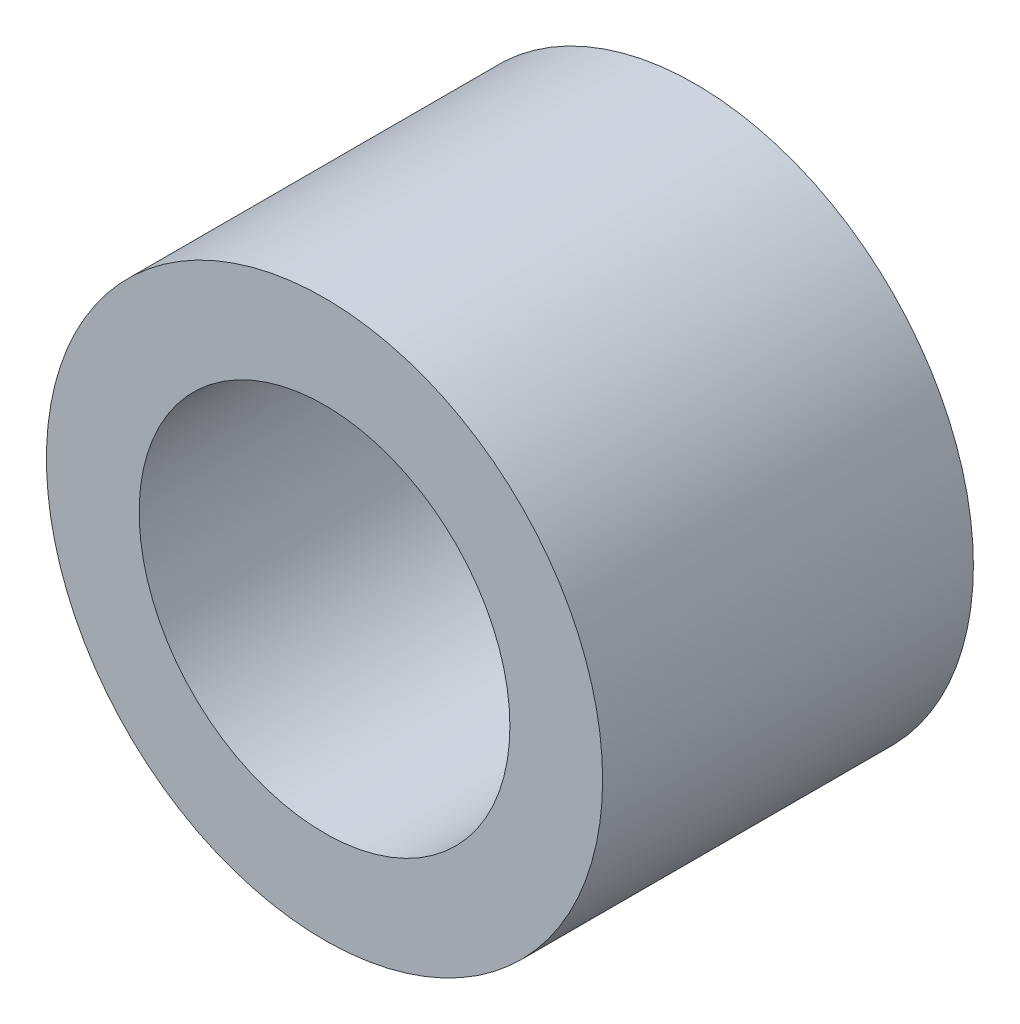
ISO-10303-21;
HEADER;
FILE_DESCRIPTION(('STEP AP214'),'2;1');
FILE_NAME('part.step','',(''),(''),'','','');
FILE_SCHEMA(('AUTOMOTIVE_DESIGN { 1 0 10303 214 1 1 1 1 }'));
ENDSEC;
DATA;
#1=APPLICATION_CONTEXT('core data for automotive mechanical design processes');
#2=APPLICATION_PROTOCOL_DEFINITION('international standard','automotive_design',2000,#1);
#3=PRODUCT_CONTEXT('',#1,'mechanical');
#4=PRODUCT('Part','Part','',(#3));
#5=PRODUCT_RELATED_PRODUCT_CATEGORY('part','',(#4));
#6=PRODUCT_DEFINITION_FORMATION('','',#4);
#7=PRODUCT_DEFINITION_CONTEXT('part definition',#1,'design');
#8=PRODUCT_DEFINITION('design','',#6,#7);
#9=PRODUCT_DEFINITION_SHAPE('','',#8);
#10=(LENGTH_UNIT() NAMED_UNIT(*) SI_UNIT(.MILLI.,.METRE.));
#11=(NAMED_UNIT(*) PLANE_ANGLE_UNIT() SI_UNIT($,.RADIAN.));
#12=(NAMED_UNIT(*) SI_UNIT($,.STERADIAN.) SOLID_ANGLE_UNIT());
#13=UNCERTAINTY_MEASURE_WITH_UNIT(LENGTH_MEASURE(1.E-05),#10,'distance_accuracy_value','');
#14=(GEOMETRIC_REPRESENTATION_CONTEXT(3) GLOBAL_UNCERTAINTY_ASSIGNED_CONTEXT((#13)) GLOBAL_UNIT_ASSIGNED_CONTEXT((#10,
#11,#12)) REPRESENTATION_CONTEXT('',''));
#15=CARTESIAN_POINT('',(0.,0.,0.));
#16=DIRECTION('',(0.,0.,1.));
#17=DIRECTION('',(1.,0.,0.));
#18=AXIS2_PLACEMENT_3D('',#15,#16,#17);
#19=CARTESIAN_POINT('',(0.,0.,4.));
#20=DIRECTION('',(0.,0.,1.));
#21=DIRECTION('',(1.,0.,0.));
#22=AXIS2_PLACEMENT_3D('',#19,#20,#21);
#23=PLANE('',#22);
#24=CARTESIAN_POINT('',(0.,0.,4.));
#25=DIRECTION('',(0.,0.,1.));
#26=DIRECTION('',(1.,0.,0.));
#27=AXIS2_PLACEMENT_3D('',#24,#25,#26);
#28=CIRCLE('',#27,3.);
#29=CARTESIAN_POINT('',(3.,0.,4.));
#30=VERTEX_POINT('',#29);
#31=EDGE_CURVE('E10',#30,#30,#28,.T.);
#32=ORIENTED_EDGE('',*,*,#31,.T.);
#33=EDGE_LOOP('',(#32));
#34=FACE_BOUND('',#33,.T.);
#35=CARTESIAN_POINT('',(0.,0.,4.));
#36=DIRECTION('',(0.,0.,1.));
#37=DIRECTION('',(1.,0.,0.));
#38=AXIS2_PLACEMENT_3D('',#35,#36,#37);
#39=CIRCLE('',#38,2.);
#40=CARTESIAN_POINT('',(2.,0.,4.));
#41=VERTEX_POINT('',#40);
#42=EDGE_CURVE('E46',#41,#41,#39,.T.);
#43=ORIENTED_EDGE('',*,*,#42,.F.);
#44=EDGE_LOOP('',(#43));
#45=FACE_BOUND('',#44,.T.);
#46=ADVANCED_FACE('F35',(#34,#45),#23,.T.);
#47=CARTESIAN_POINT('',(0.,0.,0.));
#48=DIRECTION('',(0.,0.,1.));
#49=DIRECTION('',(1.,0.,0.));
#50=AXIS2_PLACEMENT_3D('',#47,#48,#49);
#51=PLANE('',#50);
#52=CARTESIAN_POINT('',(0.,0.,0.));
#53=DIRECTION('',(0.,0.,1.));
#54=DIRECTION('',(1.,0.,0.));
#55=AXIS2_PLACEMENT_3D('',#52,#53,#54);
#56=CIRCLE('',#55,3.);
#57=CARTESIAN_POINT('',(3.,0.,0.));
#58=VERTEX_POINT('',#57);
#59=EDGE_CURVE('E42',#58,#58,#56,.T.);
#60=ORIENTED_EDGE('',*,*,#59,.F.);
#61=EDGE_LOOP('',(#60));
#62=FACE_BOUND('',#61,.T.);
#63=CARTESIAN_POINT('',(0.,0.,0.));
#64=DIRECTION('',(0.,0.,1.));
#65=DIRECTION('',(1.,0.,0.));
#66=AXIS2_PLACEMENT_3D('',#63,#64,#65);
#67=CIRCLE('',#66,2.);
#68=CARTESIAN_POINT('',(2.,0.,0.));
#69=VERTEX_POINT('',#68);
#70=EDGE_CURVE('E50',#69,#69,#67,.T.);
#71=ORIENTED_EDGE('',*,*,#70,.T.);
#72=EDGE_LOOP('',(#71));
#73=FACE_BOUND('',#72,.T.);
#74=ADVANCED_FACE('F56',(#62,#73),#51,.F.);
#75=CARTESIAN_POINT('',(0.,0.,4.));
#76=DIRECTION('',(0.,0.,-1.));
#77=DIRECTION('',(-1.,0.,0.));
#78=AXIS2_PLACEMENT_3D('',#75,#76,#77);
#79=CYLINDRICAL_SURFACE('',#78,3.);
#80=ORIENTED_EDGE('',*,*,#31,.F.);
#81=EDGE_LOOP('',(#80));
#82=FACE_BOUND('',#81,.T.);
#83=ORIENTED_EDGE('',*,*,#59,.T.);
#84=EDGE_LOOP('',(#83));
#85=FACE_BOUND('',#84,.T.);
#86=ADVANCED_FACE('F37',(#82,#85),#79,.T.);
#87=CARTESIAN_POINT('',(0.,0.,4.));
#88=DIRECTION('',(0.,0.,-1.));
#89=DIRECTION('',(-1.,0.,0.));
#90=AXIS2_PLACEMENT_3D('',#87,#88,#89);
#91=CYLINDRICAL_SURFACE('',#90,2.);
#92=ORIENTED_EDGE('',*,*,#42,.T.);
#93=EDGE_LOOP('',(#92));
#94=FACE_BOUND('',#93,.T.);
#95=ORIENTED_EDGE('',*,*,#70,.F.);
#96=EDGE_LOOP('',(#95));
#97=FACE_BOUND('',#96,.T.);
#98=ADVANCED_FACE('F58',(#94,#97),#91,.F.);
#99=CLOSED_SHELL('',(#46,#74,#86,#98));
#100=MANIFOLD_SOLID_BREP('B2',#99);
#101=ADVANCED_BREP_SHAPE_REPRESENTATION('',(#18,#100),#14);
#102=SHAPE_DEFINITION_REPRESENTATION(#9,#101);
ENDSEC;
END-ISO-10303-21;
